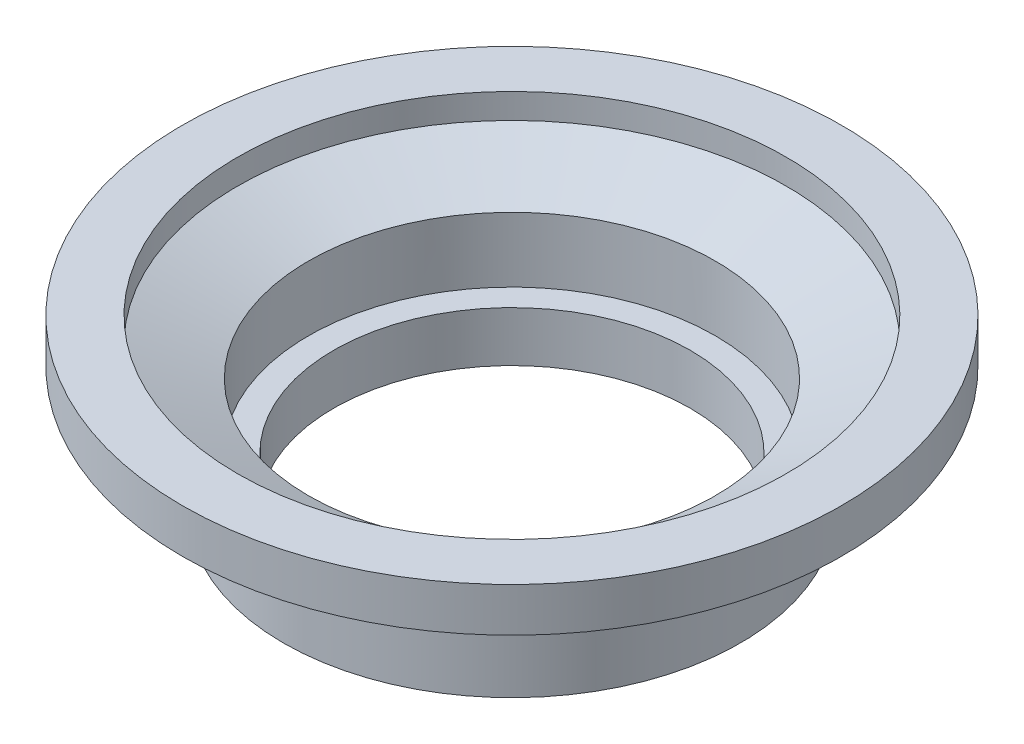
ISO-10303-21;
HEADER;
FILE_DESCRIPTION(('STEP AP214'),'2;1');
FILE_NAME('part.step','',(''),(''),'','','');
FILE_SCHEMA(('AUTOMOTIVE_DESIGN { 1 0 10303 214 1 1 1 1 }'));
ENDSEC;
DATA;
#1=APPLICATION_CONTEXT('core data for automotive mechanical design processes');
#2=APPLICATION_PROTOCOL_DEFINITION('international standard','automotive_design',2000,#1);
#3=PRODUCT_CONTEXT('',#1,'mechanical');
#4=PRODUCT('Part','Part','',(#3));
#5=PRODUCT_RELATED_PRODUCT_CATEGORY('part','',(#4));
#6=PRODUCT_DEFINITION_FORMATION('','',#4);
#7=PRODUCT_DEFINITION_CONTEXT('part definition',#1,'design');
#8=PRODUCT_DEFINITION('design','',#6,#7);
#9=PRODUCT_DEFINITION_SHAPE('','',#8);
#10=(LENGTH_UNIT() NAMED_UNIT(*) SI_UNIT(.MILLI.,.METRE.));
#11=(NAMED_UNIT(*) PLANE_ANGLE_UNIT() SI_UNIT($,.RADIAN.));
#12=(NAMED_UNIT(*) SI_UNIT($,.STERADIAN.) SOLID_ANGLE_UNIT());
#13=UNCERTAINTY_MEASURE_WITH_UNIT(LENGTH_MEASURE(1.E-05),#10,'distance_accuracy_value','');
#14=(GEOMETRIC_REPRESENTATION_CONTEXT(3) GLOBAL_UNCERTAINTY_ASSIGNED_CONTEXT((#13)) GLOBAL_UNIT_ASSIGNED_CONTEXT((#10,
#11,#12)) REPRESENTATION_CONTEXT('',''));
#15=CARTESIAN_POINT('',(0.,0.,0.));
#16=DIRECTION('',(0.,0.,1.));
#17=DIRECTION('',(1.,0.,0.));
#18=AXIS2_PLACEMENT_3D('',#15,#16,#17);
#19=CARTESIAN_POINT('',(0.,0.,0.));
#20=DIRECTION('',(0.,1.,0.));
#21=DIRECTION('',(0.,0.,1.));
#22=AXIS2_PLACEMENT_3D('',#19,#20,#21);
#23=CYLINDRICAL_SURFACE('',#22,4.1148);
#24=CARTESIAN_POINT('',(0.,2.83456211663838,0.));
#25=DIRECTION('',(0.,1.,0.));
#26=DIRECTION('',(0.,0.,1.));
#27=AXIS2_PLACEMENT_3D('',#24,#25,#26);
#28=CIRCLE('',#27,4.1148);
#29=CARTESIAN_POINT('',(0.,2.83456211663838,4.1148));
#30=VERTEX_POINT('',#29);
#31=EDGE_CURVE('E38',#30,#30,#28,.T.);
#32=ORIENTED_EDGE('',*,*,#31,.T.);
#33=EDGE_LOOP('',(#32));
#34=FACE_BOUND('',#33,.T.);
#35=CARTESIAN_POINT('',(0.,1.524,0.));
#36=DIRECTION('',(0.,-1.,0.));
#37=DIRECTION('',(0.,0.,-1.));
#38=AXIS2_PLACEMENT_3D('',#35,#36,#37);
#39=CIRCLE('',#38,4.1148);
#40=CARTESIAN_POINT('',(0.,1.524,-4.1148));
#41=VERTEX_POINT('',#40);
#42=EDGE_CURVE('E10',#41,#41,#39,.F.);
#43=ORIENTED_EDGE('',*,*,#42,.F.);
#44=EDGE_LOOP('',(#43));
#45=FACE_BOUND('',#44,.T.);
#46=ADVANCED_FACE('F31',(#34,#45),#23,.F.);
#47=CARTESIAN_POINT('',(0.,0.,0.));
#48=DIRECTION('',(0.,1.,0.));
#49=DIRECTION('',(0.,0.,1.));
#50=AXIS2_PLACEMENT_3D('',#47,#48,#49);
#51=CYLINDRICAL_SURFACE('',#50,4.6228);
#52=CARTESIAN_POINT('',(0.,2.30379006199591,0.));
#53=DIRECTION('',(0.,1.,0.));
#54=DIRECTION('',(0.,0.,1.));
#55=AXIS2_PLACEMENT_3D('',#52,#53,#54);
#56=CIRCLE('',#55,4.6228);
#57=CARTESIAN_POINT('',(0.,2.30379006199591,4.6228));
#58=VERTEX_POINT('',#57);
#59=EDGE_CURVE('E56',#58,#58,#56,.T.);
#60=ORIENTED_EDGE('',*,*,#59,.F.);
#61=EDGE_LOOP('',(#60));
#62=FACE_BOUND('',#61,.T.);
#63=CARTESIAN_POINT('',(0.,0.508,0.));
#64=DIRECTION('',(0.,-1.,0.));
#65=DIRECTION('',(0.,0.,-1.));
#66=AXIS2_PLACEMENT_3D('',#63,#64,#65);
#67=CIRCLE('',#66,4.6228);
#68=CARTESIAN_POINT('',(0.,0.508,-4.6228));
#69=VERTEX_POINT('',#68);
#70=EDGE_CURVE('E59',#69,#69,#67,.T.);
#71=ORIENTED_EDGE('',*,*,#70,.F.);
#72=EDGE_LOOP('',(#71));
#73=FACE_BOUND('',#72,.T.);
#74=ADVANCED_FACE('F80',(#62,#73),#51,.T.);
#75=CARTESIAN_POINT('',(0.,3.429,0.));
#76=DIRECTION('',(0.,1.,0.));
#77=DIRECTION('',(0.,0.,1.));
#78=AXIS2_PLACEMENT_3D('',#75,#76,#77);
#79=CONICAL_SURFACE('',#78,5.5499,1.17809724509618);
#80=ORIENTED_EDGE('',*,*,#31,.F.);
#81=EDGE_LOOP('',(#80));
#82=FACE_BOUND('',#81,.T.);
#83=CARTESIAN_POINT('',(0.,3.429,0.));
#84=DIRECTION('',(0.,1.,0.));
#85=DIRECTION('',(0.,0.,1.));
#86=AXIS2_PLACEMENT_3D('',#83,#84,#85);
#87=CIRCLE('',#86,5.5499);
#88=CARTESIAN_POINT('',(0.,3.429,5.5499));
#89=VERTEX_POINT('',#88);
#90=EDGE_CURVE('E42',#89,#89,#87,.T.);
#91=ORIENTED_EDGE('',*,*,#90,.T.);
#92=EDGE_LOOP('',(#91));
#93=FACE_BOUND('',#92,.T.);
#94=ADVANCED_FACE('F85',(#82,#93),#79,.F.);
#95=CARTESIAN_POINT('',(0.,0.,0.));
#96=DIRECTION('',(0.,1.,0.));
#97=DIRECTION('',(0.,0.,1.));
#98=AXIS2_PLACEMENT_3D('',#95,#96,#97);
#99=CYLINDRICAL_SURFACE('',#98,5.5499);
#100=ORIENTED_EDGE('',*,*,#90,.F.);
#101=EDGE_LOOP('',(#100));
#102=FACE_BOUND('',#101,.T.);
#103=CARTESIAN_POINT('',(0.,3.937,0.));
#104=DIRECTION('',(0.,1.,0.));
#105=DIRECTION('',(0.,0.,1.));
#106=AXIS2_PLACEMENT_3D('',#103,#104,#105);
#107=CIRCLE('',#106,5.5499);
#108=CARTESIAN_POINT('',(0.,3.937,5.5499));
#109=VERTEX_POINT('',#108);
#110=EDGE_CURVE('E47',#109,#109,#107,.T.);
#111=ORIENTED_EDGE('',*,*,#110,.T.);
#112=EDGE_LOOP('',(#111));
#113=FACE_BOUND('',#112,.T.);
#114=ADVANCED_FACE('F93',(#102,#113),#99,.F.);
#115=CARTESIAN_POINT('',(5.5499,3.937,0.));
#116=DIRECTION('',(0.,-1.,0.));
#117=DIRECTION('',(0.,0.,-1.));
#118=AXIS2_PLACEMENT_3D('',#115,#116,#117);
#119=PLANE('',#118);
#120=ORIENTED_EDGE('',*,*,#110,.F.);
#121=EDGE_LOOP('',(#120));
#122=FACE_BOUND('',#121,.T.);
#123=CARTESIAN_POINT('',(0.,3.937,0.));
#124=DIRECTION('',(0.,1.,0.));
#125=DIRECTION('',(0.,0.,1.));
#126=AXIS2_PLACEMENT_3D('',#123,#124,#125);
#127=CIRCLE('',#126,6.6675);
#128=CARTESIAN_POINT('',(0.,3.937,6.6675));
#129=VERTEX_POINT('',#128);
#130=EDGE_CURVE('E50',#129,#129,#127,.T.);
#131=ORIENTED_EDGE('',*,*,#130,.T.);
#132=EDGE_LOOP('',(#131));
#133=FACE_BOUND('',#132,.T.);
#134=ADVANCED_FACE('F98',(#122,#133),#119,.F.);
#135=CARTESIAN_POINT('',(0.,0.,0.));
#136=DIRECTION('',(0.,1.,0.));
#137=DIRECTION('',(0.,0.,1.));
#138=AXIS2_PLACEMENT_3D('',#135,#136,#137);
#139=CYLINDRICAL_SURFACE('',#138,6.6675);
#140=ORIENTED_EDGE('',*,*,#130,.F.);
#141=EDGE_LOOP('',(#140));
#142=FACE_BOUND('',#141,.T.);
#143=CARTESIAN_POINT('',(0.,3.048,0.));
#144=DIRECTION('',(0.,1.,0.));
#145=DIRECTION('',(0.,0.,1.));
#146=AXIS2_PLACEMENT_3D('',#143,#144,#145);
#147=CIRCLE('',#146,6.6675);
#148=CARTESIAN_POINT('',(0.,3.048,6.6675));
#149=VERTEX_POINT('',#148);
#150=EDGE_CURVE('E53',#149,#149,#147,.T.);
#151=ORIENTED_EDGE('',*,*,#150,.T.);
#152=EDGE_LOOP('',(#151));
#153=FACE_BOUND('',#152,.T.);
#154=ADVANCED_FACE('F104',(#142,#153),#139,.T.);
#155=CARTESIAN_POINT('',(0.,2.30379006199591,0.));
#156=DIRECTION('',(0.,1.,0.));
#157=DIRECTION('',(0.,0.,1.));
#158=AXIS2_PLACEMENT_3D('',#155,#156,#157);
#159=CONICAL_SURFACE('',#158,4.6228,1.22173047639604);
#160=ORIENTED_EDGE('',*,*,#150,.F.);
#161=EDGE_LOOP('',(#160));
#162=FACE_BOUND('',#161,.T.);
#163=ORIENTED_EDGE('',*,*,#59,.T.);
#164=EDGE_LOOP('',(#163));
#165=FACE_BOUND('',#164,.T.);
#166=ADVANCED_FACE('F110',(#162,#165),#159,.T.);
#167=CARTESIAN_POINT('',(0.,0.508,0.));
#168=DIRECTION('',(0.,-1.,0.));
#169=DIRECTION('',(0.,0.,-1.));
#170=AXIS2_PLACEMENT_3D('',#167,#168,#169);
#171=PLANE('',#170);
#172=CARTESIAN_POINT('',(0.,0.508,0.));
#173=DIRECTION('',(0.,-1.,0.));
#174=DIRECTION('',(0.,0.,-1.));
#175=AXIS2_PLACEMENT_3D('',#172,#173,#174);
#176=CIRCLE('',#175,3.6068);
#177=CARTESIAN_POINT('',(0.,0.508,-3.6068));
#178=VERTEX_POINT('',#177);
#179=EDGE_CURVE('E62',#178,#178,#176,.T.);
#180=ORIENTED_EDGE('',*,*,#179,.F.);
#181=EDGE_LOOP('',(#180));
#182=FACE_BOUND('',#181,.T.);
#183=ORIENTED_EDGE('',*,*,#70,.T.);
#184=EDGE_LOOP('',(#183));
#185=FACE_BOUND('',#184,.T.);
#186=ADVANCED_FACE('F77',(#182,#185),#171,.T.);
#187=CARTESIAN_POINT('',(0.,1.524,0.));
#188=DIRECTION('',(0.,-1.,0.));
#189=DIRECTION('',(0.,0.,-1.));
#190=AXIS2_PLACEMENT_3D('',#187,#188,#189);
#191=PLANE('',#190);
#192=CARTESIAN_POINT('',(0.,1.524,0.));
#193=DIRECTION('',(0.,-1.,0.));
#194=DIRECTION('',(0.,0.,-1.));
#195=AXIS2_PLACEMENT_3D('',#192,#193,#194);
#196=CIRCLE('',#195,3.6068);
#197=CARTESIAN_POINT('',(0.,1.524,-3.6068));
#198=VERTEX_POINT('',#197);
#199=EDGE_CURVE('E34',#198,#198,#196,.T.);
#200=ORIENTED_EDGE('',*,*,#199,.T.);
#201=EDGE_LOOP('',(#200));
#202=FACE_BOUND('',#201,.T.);
#203=ORIENTED_EDGE('',*,*,#42,.T.);
#204=EDGE_LOOP('',(#203));
#205=FACE_BOUND('',#204,.T.);
#206=ADVANCED_FACE('F69',(#202,#205),#191,.F.);
#207=CARTESIAN_POINT('',(0.,3.937,0.));
#208=DIRECTION('',(0.,-1.,0.));
#209=DIRECTION('',(0.,0.,-1.));
#210=AXIS2_PLACEMENT_3D('',#207,#208,#209);
#211=CYLINDRICAL_SURFACE('',#210,3.6068);
#212=ORIENTED_EDGE('',*,*,#179,.T.);
#213=EDGE_LOOP('',(#212));
#214=FACE_BOUND('',#213,.T.);
#215=ORIENTED_EDGE('',*,*,#199,.F.);
#216=EDGE_LOOP('',(#215));
#217=FACE_BOUND('',#216,.T.);
#218=ADVANCED_FACE('F71',(#214,#217),#211,.F.);
#219=CLOSED_SHELL('',(#46,#74,#94,#114,#134,#154,#166,#186,#206,#218));
#220=MANIFOLD_SOLID_BREP('B2',#219);
#221=ADVANCED_BREP_SHAPE_REPRESENTATION('',(#18,#220),#14);
#222=SHAPE_DEFINITION_REPRESENTATION(#9,#221);
ENDSEC;
END-ISO-10303-21;
